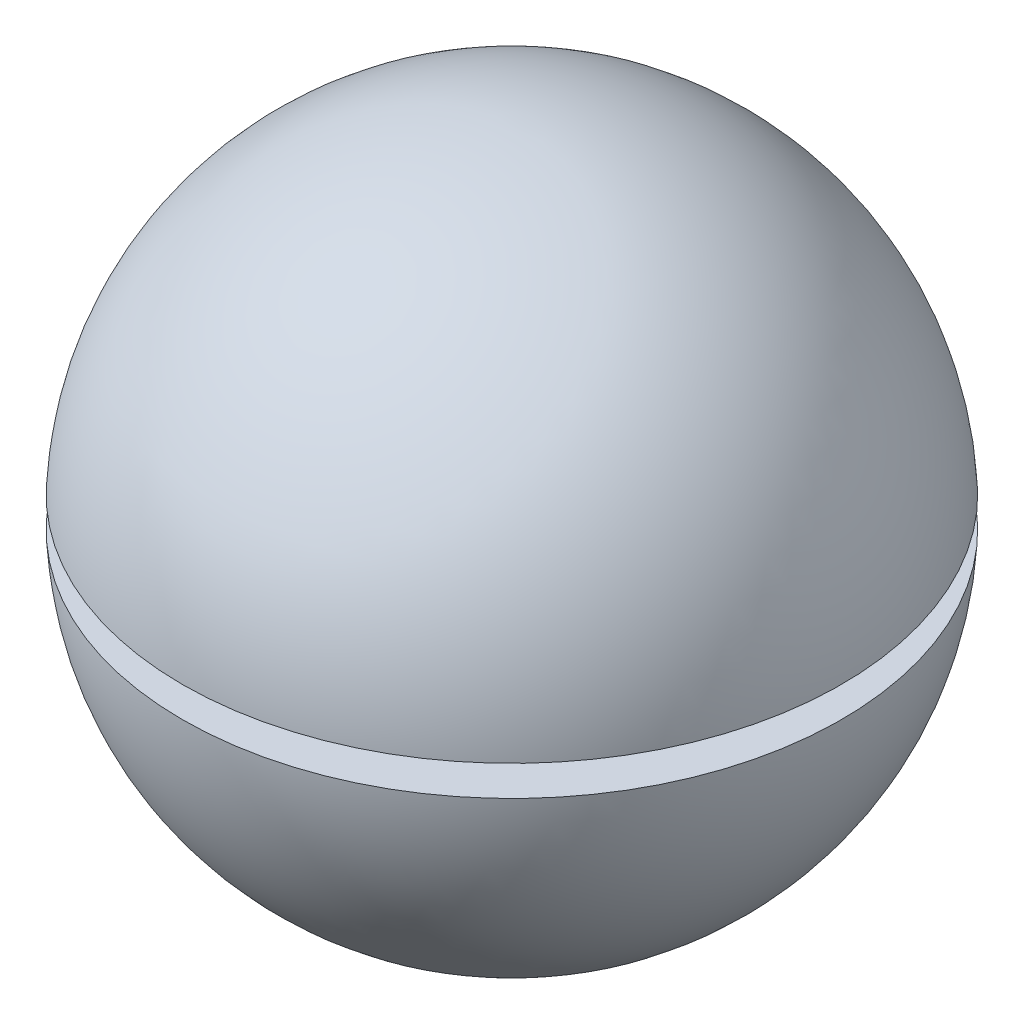
ISO-10303-21;
HEADER;
FILE_DESCRIPTION(('STEP AP214'),'2;1');
FILE_NAME('part.step','',(''),(''),'','','');
FILE_SCHEMA(('AUTOMOTIVE_DESIGN { 1 0 10303 214 1 1 1 1 }'));
ENDSEC;
DATA;
#1=APPLICATION_CONTEXT('core data for automotive mechanical design processes');
#2=APPLICATION_PROTOCOL_DEFINITION('international standard','automotive_design',2000,#1);
#3=PRODUCT_CONTEXT('',#1,'mechanical');
#4=PRODUCT('Part','Part','',(#3));
#5=PRODUCT_RELATED_PRODUCT_CATEGORY('part','',(#4));
#6=PRODUCT_DEFINITION_FORMATION('','',#4);
#7=PRODUCT_DEFINITION_CONTEXT('part definition',#1,'design');
#8=PRODUCT_DEFINITION('design','',#6,#7);
#9=PRODUCT_DEFINITION_SHAPE('','',#8);
#10=(LENGTH_UNIT() NAMED_UNIT(*) SI_UNIT(.MILLI.,.METRE.));
#11=(NAMED_UNIT(*) PLANE_ANGLE_UNIT() SI_UNIT($,.RADIAN.));
#12=(NAMED_UNIT(*) SI_UNIT($,.STERADIAN.) SOLID_ANGLE_UNIT());
#13=UNCERTAINTY_MEASURE_WITH_UNIT(LENGTH_MEASURE(1.E-05),#10,'distance_accuracy_value','');
#14=(GEOMETRIC_REPRESENTATION_CONTEXT(3) GLOBAL_UNCERTAINTY_ASSIGNED_CONTEXT((#13)) GLOBAL_UNIT_ASSIGNED_CONTEXT((#10,
#11,#12)) REPRESENTATION_CONTEXT('',''));
#15=CARTESIAN_POINT('',(0.,0.,0.));
#16=DIRECTION('',(0.,0.,1.));
#17=DIRECTION('',(1.,0.,0.));
#18=AXIS2_PLACEMENT_3D('',#15,#16,#17);
#19=CARTESIAN_POINT('',(0.,0.,0.));
#20=DIRECTION('',(-1.,0.,0.));
#21=DIRECTION('',(0.,1.,0.));
#22=AXIS2_PLACEMENT_3D('',#19,#20,#21);
#23=SPHERICAL_SURFACE('',#22,44.45);
#24=CARTESIAN_POINT('',(0.,0.,0.));
#25=DIRECTION('',(0.,1.,0.));
#26=DIRECTION('',(0.,0.,1.));
#27=AXIS2_PLACEMENT_3D('',#24,#25,#26);
#28=SPHERICAL_SURFACE('',#27,44.45);
#29=CARTESIAN_POINT('',(0.,-2.05,0.));
#30=DIRECTION('',(0.,1.,0.));
#31=DIRECTION('',(0.,0.,1.));
#32=AXIS2_PLACEMENT_3D('',#29,#30,#31);
#33=CIRCLE('',#32,44.4027026204487);
#34=CARTESIAN_POINT('',(0.,-2.05,44.4027026204487));
#35=VERTEX_POINT('',#34);
#36=EDGE_CURVE('E11',#35,#35,#33,.T.);
#37=ORIENTED_EDGE('',*,*,#36,.F.);
#38=EDGE_LOOP('',(#37));
#39=FACE_BOUND('',#38,.T.);
#40=ADVANCED_FACE('F46',(#39),#28,.T.);
#41=CARTESIAN_POINT('',(0.,-2.05,0.));
#42=DIRECTION('',(0.,1.,0.));
#43=DIRECTION('',(0.,0.,1.));
#44=AXIS2_PLACEMENT_3D('',#41,#42,#43);
#45=PLANE('',#44);
#46=ORIENTED_EDGE('',*,*,#36,.T.);
#47=EDGE_LOOP('',(#46));
#48=FACE_BOUND('',#47,.T.);
#49=ADVANCED_FACE('F53',(#48),#45,.T.);
#50=CLOSED_SHELL('',(#40,#49));
#51=MANIFOLD_SOLID_BREP('B2',#50);
#52=CARTESIAN_POINT('',(0.,0.,0.));
#53=DIRECTION('',(-1.,0.,0.));
#54=DIRECTION('',(0.,1.,0.));
#55=AXIS2_PLACEMENT_3D('',#52,#53,#54);
#56=SPHERICAL_SURFACE('',#55,44.45);
#57=CARTESIAN_POINT('',(0.,0.,0.));
#58=DIRECTION('',(0.,1.,0.));
#59=DIRECTION('',(0.,0.,1.));
#60=AXIS2_PLACEMENT_3D('',#57,#58,#59);
#61=SPHERICAL_SURFACE('',#60,44.45);
#62=CARTESIAN_POINT('',(0.,2.05,0.));
#63=DIRECTION('',(0.,1.,0.));
#64=DIRECTION('',(0.,0.,1.));
#65=AXIS2_PLACEMENT_3D('',#62,#63,#64);
#66=CIRCLE('',#65,44.4027026204487);
#67=CARTESIAN_POINT('',(0.,2.05,44.4027026204487));
#68=VERTEX_POINT('',#67);
#69=EDGE_CURVE('E45',#68,#68,#66,.T.);
#70=ORIENTED_EDGE('',*,*,#69,.T.);
#71=EDGE_LOOP('',(#70));
#72=FACE_BOUND('',#71,.T.);
#73=ADVANCED_FACE('F71',(#72),#61,.T.);
#74=CARTESIAN_POINT('',(0.,2.05,0.));
#75=DIRECTION('',(0.,1.,0.));
#76=DIRECTION('',(0.,0.,1.));
#77=AXIS2_PLACEMENT_3D('',#74,#75,#76);
#78=PLANE('',#77);
#79=ORIENTED_EDGE('',*,*,#69,.F.);
#80=EDGE_LOOP('',(#79));
#81=FACE_BOUND('',#80,.T.);
#82=ADVANCED_FACE('F80',(#81),#78,.F.);
#83=CLOSED_SHELL('',(#73,#82));
#84=MANIFOLD_SOLID_BREP('B6',#83);
#85=ADVANCED_BREP_SHAPE_REPRESENTATION('',(#18,#51,#84),#14);
#86=SHAPE_DEFINITION_REPRESENTATION(#9,#85);
ENDSEC;
END-ISO-10303-21;
